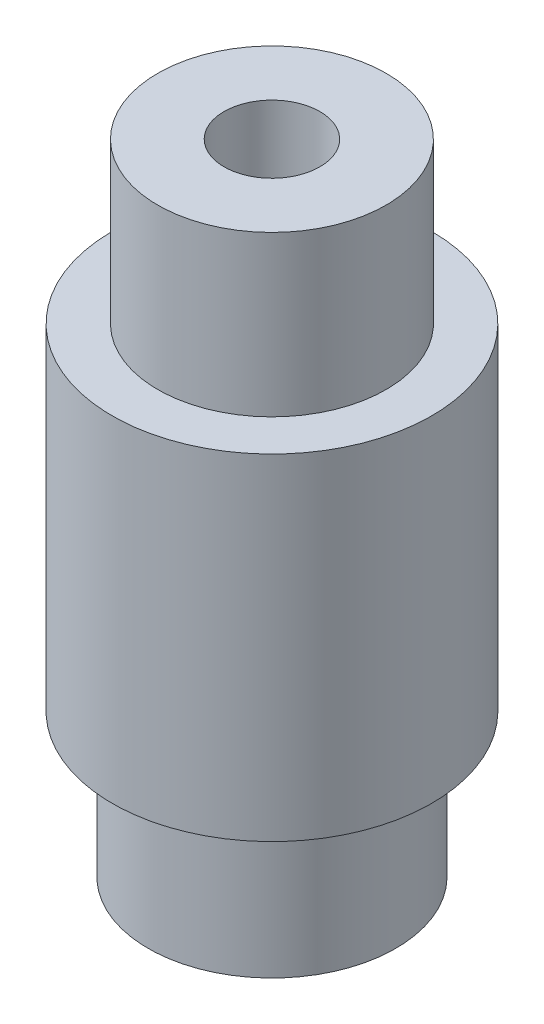
ISO-10303-21;
HEADER;
FILE_DESCRIPTION(('STEP AP214'),'2;1');
FILE_NAME('part.step','',(''),(''),'','','');
FILE_SCHEMA(('AUTOMOTIVE_DESIGN { 1 0 10303 214 1 1 1 1 }'));
ENDSEC;
DATA;
#1=APPLICATION_CONTEXT('core data for automotive mechanical design processes');
#2=APPLICATION_PROTOCOL_DEFINITION('international standard','automotive_design',2000,#1);
#3=PRODUCT_CONTEXT('',#1,'mechanical');
#4=PRODUCT('Part','Part','',(#3));
#5=PRODUCT_RELATED_PRODUCT_CATEGORY('part','',(#4));
#6=PRODUCT_DEFINITION_FORMATION('','',#4);
#7=PRODUCT_DEFINITION_CONTEXT('part definition',#1,'design');
#8=PRODUCT_DEFINITION('design','',#6,#7);
#9=PRODUCT_DEFINITION_SHAPE('','',#8);
#10=(LENGTH_UNIT() NAMED_UNIT(*) SI_UNIT(.MILLI.,.METRE.));
#11=(NAMED_UNIT(*) PLANE_ANGLE_UNIT() SI_UNIT($,.RADIAN.));
#12=(NAMED_UNIT(*) SI_UNIT($,.STERADIAN.) SOLID_ANGLE_UNIT());
#13=UNCERTAINTY_MEASURE_WITH_UNIT(LENGTH_MEASURE(1.E-05),#10,'distance_accuracy_value','');
#14=(GEOMETRIC_REPRESENTATION_CONTEXT(3) GLOBAL_UNCERTAINTY_ASSIGNED_CONTEXT((#13)) GLOBAL_UNIT_ASSIGNED_CONTEXT((#10,
#11,#12)) REPRESENTATION_CONTEXT('',''));
#15=CARTESIAN_POINT('',(0.,0.,0.));
#16=DIRECTION('',(0.,0.,1.));
#17=DIRECTION('',(1.,0.,0.));
#18=AXIS2_PLACEMENT_3D('',#15,#16,#17);
#19=CARTESIAN_POINT('',(0.,-8.72843661864831,0.));
#20=DIRECTION('',(0.,-1.,0.));
#21=DIRECTION('',(0.,0.,-1.));
#22=AXIS2_PLACEMENT_3D('',#19,#20,#21);
#23=CYLINDRICAL_SURFACE('',#22,3.);
#24=CARTESIAN_POINT('',(0.,40.,0.));
#25=DIRECTION('',(0.,-1.,0.));
#26=DIRECTION('',(0.,0.,-1.));
#27=AXIS2_PLACEMENT_3D('',#24,#25,#26);
#28=CIRCLE('',#27,3.);
#29=CARTESIAN_POINT('',(0.,40.,-3.));
#30=VERTEX_POINT('',#29);
#31=EDGE_CURVE('E69',#30,#30,#28,.T.);
#32=ORIENTED_EDGE('',*,*,#31,.F.);
#33=EDGE_LOOP('',(#32));
#34=FACE_BOUND('',#33,.T.);
#35=CARTESIAN_POINT('',(0.,0.,0.));
#36=DIRECTION('',(0.,-1.,0.));
#37=DIRECTION('',(0.,0.,-1.));
#38=AXIS2_PLACEMENT_3D('',#35,#36,#37);
#39=CIRCLE('',#38,3.);
#40=CARTESIAN_POINT('',(0.,0.,-3.));
#41=VERTEX_POINT('',#40);
#42=EDGE_CURVE('E12',#41,#41,#39,.T.);
#43=ORIENTED_EDGE('',*,*,#42,.T.);
#44=EDGE_LOOP('',(#43));
#45=FACE_BOUND('',#44,.T.);
#46=ADVANCED_FACE('F41',(#34,#45),#23,.F.);
#47=CARTESIAN_POINT('',(-3.,0.,0.));
#48=DIRECTION('',(0.,1.,0.));
#49=DIRECTION('',(0.,0.,1.));
#50=AXIS2_PLACEMENT_3D('',#47,#48,#49);
#51=PLANE('',#50);
#52=ORIENTED_EDGE('',*,*,#42,.F.);
#53=EDGE_LOOP('',(#52));
#54=FACE_BOUND('',#53,.T.);
#55=CARTESIAN_POINT('',(0.,0.,0.));
#56=DIRECTION('',(0.,-1.,0.));
#57=DIRECTION('',(0.,0.,-1.));
#58=AXIS2_PLACEMENT_3D('',#55,#56,#57);
#59=CIRCLE('',#58,7.75);
#60=CARTESIAN_POINT('',(0.,0.,-7.75));
#61=VERTEX_POINT('',#60);
#62=EDGE_CURVE('E47',#61,#61,#59,.T.);
#63=ORIENTED_EDGE('',*,*,#62,.T.);
#64=EDGE_LOOP('',(#63));
#65=FACE_BOUND('',#64,.T.);
#66=ADVANCED_FACE('F76',(#54,#65),#51,.F.);
#67=CARTESIAN_POINT('',(0.,-8.72843661864831,0.));
#68=DIRECTION('',(0.,-1.,0.));
#69=DIRECTION('',(0.,0.,-1.));
#70=AXIS2_PLACEMENT_3D('',#67,#68,#69);
#71=CYLINDRICAL_SURFACE('',#70,7.75);
#72=ORIENTED_EDGE('',*,*,#62,.F.);
#73=EDGE_LOOP('',(#72));
#74=FACE_BOUND('',#73,.T.);
#75=CARTESIAN_POINT('',(0.,8.98787411380068,0.));
#76=DIRECTION('',(0.,-1.,0.));
#77=DIRECTION('',(0.,0.,-1.));
#78=AXIS2_PLACEMENT_3D('',#75,#76,#77);
#79=CIRCLE('',#78,7.75);
#80=CARTESIAN_POINT('',(0.,8.98787411380068,-7.75));
#81=VERTEX_POINT('',#80);
#82=EDGE_CURVE('E51',#81,#81,#79,.T.);
#83=ORIENTED_EDGE('',*,*,#82,.T.);
#84=EDGE_LOOP('',(#83));
#85=FACE_BOUND('',#84,.T.);
#86=ADVANCED_FACE('F80',(#74,#85),#71,.T.);
#87=CARTESIAN_POINT('',(-7.75,8.98787411380068,0.));
#88=DIRECTION('',(0.,1.,0.));
#89=DIRECTION('',(0.,0.,1.));
#90=AXIS2_PLACEMENT_3D('',#87,#88,#89);
#91=PLANE('',#90);
#92=ORIENTED_EDGE('',*,*,#82,.F.);
#93=EDGE_LOOP('',(#92));
#94=FACE_BOUND('',#93,.T.);
#95=CARTESIAN_POINT('',(0.,8.98787411380068,0.));
#96=DIRECTION('',(0.,-1.,0.));
#97=DIRECTION('',(0.,0.,-1.));
#98=AXIS2_PLACEMENT_3D('',#95,#96,#97);
#99=CIRCLE('',#98,10.);
#100=CARTESIAN_POINT('',(0.,8.98787411380068,-10.));
#101=VERTEX_POINT('',#100);
#102=EDGE_CURVE('E55',#101,#101,#99,.T.);
#103=ORIENTED_EDGE('',*,*,#102,.T.);
#104=EDGE_LOOP('',(#103));
#105=FACE_BOUND('',#104,.T.);
#106=ADVANCED_FACE('F85',(#94,#105),#91,.F.);
#107=CARTESIAN_POINT('',(0.,-8.72843661864831,0.));
#108=DIRECTION('',(0.,-1.,0.));
#109=DIRECTION('',(0.,0.,-1.));
#110=AXIS2_PLACEMENT_3D('',#107,#108,#109);
#111=CYLINDRICAL_SURFACE('',#110,10.);
#112=ORIENTED_EDGE('',*,*,#102,.F.);
#113=EDGE_LOOP('',(#112));
#114=FACE_BOUND('',#113,.T.);
#115=CARTESIAN_POINT('',(0.,30.,0.));
#116=DIRECTION('',(0.,-1.,0.));
#117=DIRECTION('',(0.,0.,-1.));
#118=AXIS2_PLACEMENT_3D('',#115,#116,#117);
#119=CIRCLE('',#118,10.);
#120=CARTESIAN_POINT('',(0.,30.,-10.));
#121=VERTEX_POINT('',#120);
#122=EDGE_CURVE('E60',#121,#121,#119,.T.);
#123=ORIENTED_EDGE('',*,*,#122,.T.);
#124=EDGE_LOOP('',(#123));
#125=FACE_BOUND('',#124,.T.);
#126=ADVANCED_FACE('F91',(#114,#125),#111,.T.);
#127=CARTESIAN_POINT('',(-10.,30.,0.));
#128=DIRECTION('',(0.,-1.,0.));
#129=DIRECTION('',(0.,0.,-1.));
#130=AXIS2_PLACEMENT_3D('',#127,#128,#129);
#131=PLANE('',#130);
#132=ORIENTED_EDGE('',*,*,#122,.F.);
#133=EDGE_LOOP('',(#132));
#134=FACE_BOUND('',#133,.T.);
#135=CARTESIAN_POINT('',(0.,30.,0.));
#136=DIRECTION('',(0.,-1.,0.));
#137=DIRECTION('',(0.,0.,-1.));
#138=AXIS2_PLACEMENT_3D('',#135,#136,#137);
#139=CIRCLE('',#138,7.15);
#140=CARTESIAN_POINT('',(0.,30.,-7.15));
#141=VERTEX_POINT('',#140);
#142=EDGE_CURVE('E63',#141,#141,#139,.T.);
#143=ORIENTED_EDGE('',*,*,#142,.T.);
#144=EDGE_LOOP('',(#143));
#145=FACE_BOUND('',#144,.T.);
#146=ADVANCED_FACE('F95',(#134,#145),#131,.F.);
#147=CARTESIAN_POINT('',(0.,-8.72843661864831,0.));
#148=DIRECTION('',(0.,-1.,0.));
#149=DIRECTION('',(0.,0.,-1.));
#150=AXIS2_PLACEMENT_3D('',#147,#148,#149);
#151=CYLINDRICAL_SURFACE('',#150,7.15);
#152=ORIENTED_EDGE('',*,*,#142,.F.);
#153=EDGE_LOOP('',(#152));
#154=FACE_BOUND('',#153,.T.);
#155=CARTESIAN_POINT('',(0.,40.,0.));
#156=DIRECTION('',(0.,-1.,0.));
#157=DIRECTION('',(0.,0.,-1.));
#158=AXIS2_PLACEMENT_3D('',#155,#156,#157);
#159=CIRCLE('',#158,7.15);
#160=CARTESIAN_POINT('',(0.,40.,-7.15));
#161=VERTEX_POINT('',#160);
#162=EDGE_CURVE('E66',#161,#161,#159,.T.);
#163=ORIENTED_EDGE('',*,*,#162,.T.);
#164=EDGE_LOOP('',(#163));
#165=FACE_BOUND('',#164,.T.);
#166=ADVANCED_FACE('F99',(#154,#165),#151,.T.);
#167=CARTESIAN_POINT('',(-7.15,40.,0.));
#168=DIRECTION('',(0.,-1.,0.));
#169=DIRECTION('',(0.,0.,-1.));
#170=AXIS2_PLACEMENT_3D('',#167,#168,#169);
#171=PLANE('',#170);
#172=ORIENTED_EDGE('',*,*,#162,.F.);
#173=EDGE_LOOP('',(#172));
#174=FACE_BOUND('',#173,.T.);
#175=ORIENTED_EDGE('',*,*,#31,.T.);
#176=EDGE_LOOP('',(#175));
#177=FACE_BOUND('',#176,.T.);
#178=ADVANCED_FACE('F73',(#174,#177),#171,.F.);
#179=CLOSED_SHELL('',(#46,#66,#86,#106,#126,#146,#166,#178));
#180=MANIFOLD_SOLID_BREP('B2',#179);
#181=ADVANCED_BREP_SHAPE_REPRESENTATION('',(#18,#180),#14);
#182=SHAPE_DEFINITION_REPRESENTATION(#9,#181);
ENDSEC;
END-ISO-10303-21;
